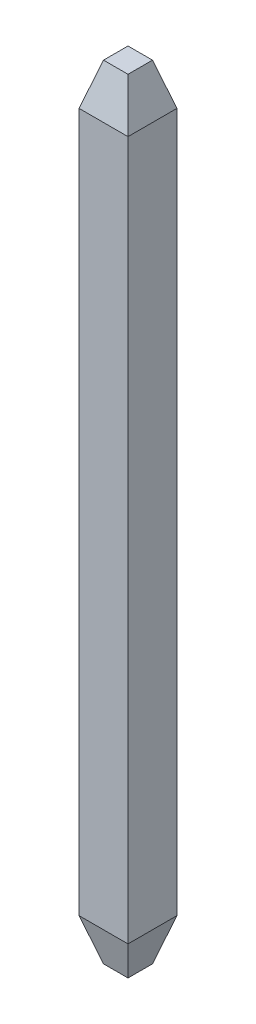
ISO-10303-21;
HEADER;
FILE_DESCRIPTION(('STEP AP214'),'2;1');
FILE_NAME('part.step','',(''),(''),'','','');
FILE_SCHEMA(('AUTOMOTIVE_DESIGN { 1 0 10303 214 1 1 1 1 }'));
ENDSEC;
DATA;
#1=APPLICATION_CONTEXT('core data for automotive mechanical design processes');
#2=APPLICATION_PROTOCOL_DEFINITION('international standard','automotive_design',2000,#1);
#3=PRODUCT_CONTEXT('',#1,'mechanical');
#4=PRODUCT('Part','Part','',(#3));
#5=PRODUCT_RELATED_PRODUCT_CATEGORY('part','',(#4));
#6=PRODUCT_DEFINITION_FORMATION('','',#4);
#7=PRODUCT_DEFINITION_CONTEXT('part definition',#1,'design');
#8=PRODUCT_DEFINITION('design','',#6,#7);
#9=PRODUCT_DEFINITION_SHAPE('','',#8);
#10=(LENGTH_UNIT() NAMED_UNIT(*) SI_UNIT(.MILLI.,.METRE.));
#11=(NAMED_UNIT(*) PLANE_ANGLE_UNIT() SI_UNIT($,.RADIAN.));
#12=(NAMED_UNIT(*) SI_UNIT($,.STERADIAN.) SOLID_ANGLE_UNIT());
#13=UNCERTAINTY_MEASURE_WITH_UNIT(LENGTH_MEASURE(1.E-05),#10,'distance_accuracy_value','');
#14=(GEOMETRIC_REPRESENTATION_CONTEXT(3) GLOBAL_UNCERTAINTY_ASSIGNED_CONTEXT((#13)) GLOBAL_UNIT_ASSIGNED_CONTEXT((#10,
#11,#12)) REPRESENTATION_CONTEXT('',''));
#15=CARTESIAN_POINT('',(0.,0.,0.));
#16=DIRECTION('',(0.,0.,1.));
#17=DIRECTION('',(1.,0.,0.));
#18=AXIS2_PLACEMENT_3D('',#15,#16,#17);
#19=CARTESIAN_POINT('',(-3.64999999998703,-10.1039999999832,-19.8399999999763));
#20=DIRECTION('',(0.,-0.281214622974643,-0.959644900900968));
#21=DIRECTION('',(0.,-0.959644900900968,0.281214622974643));
#22=AXIS2_PLACEMENT_3D('',#19,#20,#21);
#23=PLANE('',#22);
#24=DIRECTION('',(1.,0.,0.));
#25=VECTOR('',#24,1.);
#26=CARTESIAN_POINT('',(-3.96999999998703,-10.1039999999832,-19.8399999999763));
#27=LINE('',#26,#25);
#28=CARTESIAN_POINT('',(-3.96999999998703,-10.1039999999832,-19.8399999999763));
#29=VERTEX_POINT('',#28);
#30=CARTESIAN_POINT('',(-3.32999999998705,-10.1039999999832,-19.8399999999763));
#31=VERTEX_POINT('',#30);
#32=EDGE_CURVE('E11',#29,#31,#27,.T.);
#33=ORIENTED_EDGE('',*,*,#32,.T.);
#34=DIRECTION('',(-0.270714017147711,-0.923811583516622,0.270714017147728));
#35=VECTOR('',#34,1.);
#36=CARTESIAN_POINT('',(-3.32999999998702,-10.1039999999832,-19.8399999999763));
#37=LINE('',#36,#35);
#38=CARTESIAN_POINT('',(-3.48999999998704,-10.6499999999832,-19.6799999999763));
#39=VERTEX_POINT('',#38);
#40=EDGE_CURVE('E28',#31,#39,#37,.T.);
#41=ORIENTED_EDGE('',*,*,#40,.T.);
#42=DIRECTION('',(1.,0.,0.));
#43=VECTOR('',#42,1.);
#44=CARTESIAN_POINT('',(-3.80999999998703,-10.6499999999832,-19.6799999999763));
#45=LINE('',#44,#43);
#46=CARTESIAN_POINT('',(-3.80999999998703,-10.6499999999832,-19.6799999999763));
#47=VERTEX_POINT('',#46);
#48=EDGE_CURVE('E101',#47,#39,#45,.T.);
#49=ORIENTED_EDGE('',*,*,#48,.F.);
#50=DIRECTION('',(0.270714017147727,-0.923811583516618,0.270714017147727));
#51=VECTOR('',#50,1.);
#52=CARTESIAN_POINT('',(-3.96999999998703,-10.1039999999832,-19.8399999999763));
#53=LINE('',#52,#51);
#54=EDGE_CURVE('E104',#29,#47,#53,.T.);
#55=ORIENTED_EDGE('',*,*,#54,.F.);
#56=EDGE_LOOP('',(#33,#41,#49,#55));
#57=FACE_BOUND('',#56,.T.);
#58=ADVANCED_FACE('F17',(#57),#23,.T.);
#59=CARTESIAN_POINT('',(-3.32899999998701,-5.53443505344793,-19.8399999999763));
#60=DIRECTION('',(0.,0.,-1.));
#61=DIRECTION('',(0.,-1.,0.));
#62=AXIS2_PLACEMENT_3D('',#59,#60,#61);
#63=PLANE('',#62);
#64=DIRECTION('',(0.,1.,0.));
#65=VECTOR('',#64,1.);
#66=CARTESIAN_POINT('',(-3.32999999998702,-10.1039999999832,-19.8399999999763));
#67=LINE('',#66,#65);
#68=CARTESIAN_POINT('',(-3.32999999998705,-0.965870106912663,-19.8399999999763));
#69=VERTEX_POINT('',#68);
#70=EDGE_CURVE('E42',#31,#69,#67,.T.);
#71=ORIENTED_EDGE('',*,*,#70,.F.);
#72=ORIENTED_EDGE('',*,*,#32,.F.);
#73=DIRECTION('',(0.,1.,0.));
#74=VECTOR('',#73,1.);
#75=CARTESIAN_POINT('',(-3.96999999998703,-10.1039999999832,-19.8399999999763));
#76=LINE('',#75,#74);
#77=CARTESIAN_POINT('',(-3.96999999998703,-0.965870106912663,-19.8399999999763));
#78=VERTEX_POINT('',#77);
#79=EDGE_CURVE('E289',#29,#78,#76,.T.);
#80=ORIENTED_EDGE('',*,*,#79,.T.);
#81=DIRECTION('',(1.,0.,0.));
#82=VECTOR('',#81,1.);
#83=CARTESIAN_POINT('',(-3.96999999998703,-0.965870106912661,-19.8399999999763));
#84=LINE('',#83,#82);
#85=EDGE_CURVE('E198',#78,#69,#84,.T.);
#86=ORIENTED_EDGE('',*,*,#85,.T.);
#87=EDGE_LOOP('',(#71,#72,#80,#86));
#88=FACE_BOUND('',#87,.T.);
#89=ADVANCED_FACE('F453',(#88),#63,.T.);
#90=CARTESIAN_POINT('',(-3.32999999998702,-11.0738701069127,-19.5199999999763));
#91=DIRECTION('',(1.,0.,0.));
#92=DIRECTION('',(0.,1.,0.));
#93=AXIS2_PLACEMENT_3D('',#90,#91,#92);
#94=PLANE('',#93);
#95=DIRECTION('',(0.,1.,0.));
#96=VECTOR('',#95,1.);
#97=CARTESIAN_POINT('',(-3.32999999998702,-10.1039999999832,-19.1999999999763));
#98=LINE('',#97,#96);
#99=CARTESIAN_POINT('',(-3.32999999998705,-10.1039999999832,-19.1999999999763));
#100=VERTEX_POINT('',#99);
#101=CARTESIAN_POINT('',(-3.32999999998705,-0.965870106912663,-19.1999999999763));
#102=VERTEX_POINT('',#101);
#103=EDGE_CURVE('E136',#100,#102,#98,.T.);
#104=ORIENTED_EDGE('',*,*,#103,.F.);
#105=DIRECTION('',(0.,0.,1.));
#106=VECTOR('',#105,1.);
#107=CARTESIAN_POINT('',(-3.32999999998702,-10.1039999999832,-19.8399999999763));
#108=LINE('',#107,#106);
#109=EDGE_CURVE('E83',#31,#100,#108,.T.);
#110=ORIENTED_EDGE('',*,*,#109,.F.);
#111=ORIENTED_EDGE('',*,*,#70,.T.);
#112=DIRECTION('',(0.,0.,1.));
#113=VECTOR('',#112,1.);
#114=CARTESIAN_POINT('',(-3.32999999998702,-0.965870106912661,-19.8399999999763));
#115=LINE('',#114,#113);
#116=EDGE_CURVE('E139',#69,#102,#115,.T.);
#117=ORIENTED_EDGE('',*,*,#116,.T.);
#118=EDGE_LOOP('',(#104,#110,#111,#117));
#119=FACE_BOUND('',#118,.T.);
#120=ADVANCED_FACE('F270',(#119),#94,.T.);
#121=CARTESIAN_POINT('',(-3.97099999998701,-5.53543505344793,-19.1999999999763));
#122=DIRECTION('',(0.,0.,1.));
#123=DIRECTION('',(1.,0.,0.));
#124=AXIS2_PLACEMENT_3D('',#121,#122,#123);
#125=PLANE('',#124);
#126=DIRECTION('',(0.,1.,0.));
#127=VECTOR('',#126,1.);
#128=CARTESIAN_POINT('',(-3.96999999998703,-10.1039999999832,-19.1999999999763));
#129=LINE('',#128,#127);
#130=CARTESIAN_POINT('',(-3.96999999998703,-10.1039999999832,-19.1999999999763));
#131=VERTEX_POINT('',#130);
#132=CARTESIAN_POINT('',(-3.96999999998703,-0.965870106912663,-19.1999999999763));
#133=VERTEX_POINT('',#132);
#134=EDGE_CURVE('E131',#131,#133,#129,.T.);
#135=ORIENTED_EDGE('',*,*,#134,.F.);
#136=DIRECTION('',(-1.,0.,0.));
#137=VECTOR('',#136,1.);
#138=CARTESIAN_POINT('',(-3.32999999998702,-10.1039999999832,-19.1999999999763));
#139=LINE('',#138,#137);
#140=EDGE_CURVE('E116',#100,#131,#139,.T.);
#141=ORIENTED_EDGE('',*,*,#140,.F.);
#142=ORIENTED_EDGE('',*,*,#103,.T.);
#143=DIRECTION('',(-1.,0.,0.));
#144=VECTOR('',#143,1.);
#145=CARTESIAN_POINT('',(-3.32999999998702,-0.965870106912661,-19.1999999999763));
#146=LINE('',#145,#144);
#147=EDGE_CURVE('E140',#102,#133,#146,.T.);
#148=ORIENTED_EDGE('',*,*,#147,.T.);
#149=EDGE_LOOP('',(#135,#141,#142,#148));
#150=FACE_BOUND('',#149,.T.);
#151=ADVANCED_FACE('F268',(#150),#125,.T.);
#152=CARTESIAN_POINT('',(-3.64999999998703,-0.965870106912661,-19.1999999999763));
#153=DIRECTION('',(0.,0.281214622974643,0.959644900900968));
#154=DIRECTION('',(1.,0.,0.));
#155=AXIS2_PLACEMENT_3D('',#152,#153,#154);
#156=PLANE('',#155);
#157=DIRECTION('',(-0.270714017147711,0.923811583516622,-0.270714017147728));
#158=VECTOR('',#157,1.);
#159=CARTESIAN_POINT('',(-3.32999999998702,-0.965870106912661,-19.1999999999763));
#160=LINE('',#159,#158);
#161=CARTESIAN_POINT('',(-3.48999999998704,-0.419870106912663,-19.3599999999763));
#162=VERTEX_POINT('',#161);
#163=EDGE_CURVE('E21',#102,#162,#160,.T.);
#164=ORIENTED_EDGE('',*,*,#163,.T.);
#165=DIRECTION('',(-1.,0.,0.));
#166=VECTOR('',#165,1.);
#167=CARTESIAN_POINT('',(-3.48999999998701,-0.419870106912661,-19.3599999999763));
#168=LINE('',#167,#166);
#169=CARTESIAN_POINT('',(-3.80999999998703,-0.419870106912663,-19.3599999999763));
#170=VERTEX_POINT('',#169);
#171=EDGE_CURVE('E169',#162,#170,#168,.T.);
#172=ORIENTED_EDGE('',*,*,#171,.T.);
#173=DIRECTION('',(0.270714017147727,0.923811583516618,-0.270714017147727));
#174=VECTOR('',#173,1.);
#175=CARTESIAN_POINT('',(-3.96999999998703,-0.965870106912661,-19.1999999999763));
#176=LINE('',#175,#174);
#177=EDGE_CURVE('E165',#133,#170,#176,.T.);
#178=ORIENTED_EDGE('',*,*,#177,.F.);
#179=ORIENTED_EDGE('',*,*,#147,.F.);
#180=EDGE_LOOP('',(#164,#172,#178,#179));
#181=FACE_BOUND('',#180,.T.);
#182=ADVANCED_FACE('F19',(#181),#156,.T.);
#183=CARTESIAN_POINT('',(-3.96999999998703,-0.965870106912661,-19.5199999999763));
#184=DIRECTION('',(-0.959644900900968,0.281214622974643,0.));
#185=DIRECTION('',(0.,0.,1.));
#186=AXIS2_PLACEMENT_3D('',#183,#184,#185);
#187=PLANE('',#186);
#188=ORIENTED_EDGE('',*,*,#177,.T.);
#189=DIRECTION('',(0.,0.,-1.));
#190=VECTOR('',#189,1.);
#191=CARTESIAN_POINT('',(-3.80999999998703,-0.419870106912661,-19.3599999999763));
#192=LINE('',#191,#190);
#193=CARTESIAN_POINT('',(-3.80999999998703,-0.419870106912663,-19.6799999999763));
#194=VERTEX_POINT('',#193);
#195=EDGE_CURVE('E119',#170,#194,#192,.T.);
#196=ORIENTED_EDGE('',*,*,#195,.T.);
#197=DIRECTION('',(0.270714017147727,0.923811583516618,0.270714017147727));
#198=VECTOR('',#197,1.);
#199=CARTESIAN_POINT('',(-3.96999999998703,-0.965870106912661,-19.8399999999763));
#200=LINE('',#199,#198);
#201=EDGE_CURVE('E151',#78,#194,#200,.T.);
#202=ORIENTED_EDGE('',*,*,#201,.F.);
#203=DIRECTION('',(0.,0.,-1.));
#204=VECTOR('',#203,1.);
#205=CARTESIAN_POINT('',(-3.96999999998703,-0.965870106912661,-19.1999999999763));
#206=LINE('',#205,#204);
#207=EDGE_CURVE('E123',#133,#78,#206,.T.);
#208=ORIENTED_EDGE('',*,*,#207,.F.);
#209=EDGE_LOOP('',(#188,#196,#202,#208));
#210=FACE_BOUND('',#209,.T.);
#211=ADVANCED_FACE('F183',(#210),#187,.T.);
#212=CARTESIAN_POINT('',(-3.64999999998703,-0.419870106912661,-19.6809999999763));
#213=DIRECTION('',(0.,1.,0.));
#214=DIRECTION('',(1.,0.,0.));
#215=AXIS2_PLACEMENT_3D('',#212,#213,#214);
#216=PLANE('',#215);
#217=DIRECTION('',(1.,0.,0.));
#218=VECTOR('',#217,1.);
#219=CARTESIAN_POINT('',(-3.80999999998703,-0.419870106912661,-19.6799999999763));
#220=LINE('',#219,#218);
#221=CARTESIAN_POINT('',(-3.48999999998704,-0.419870106912663,-19.6799999999763));
#222=VERTEX_POINT('',#221);
#223=EDGE_CURVE('E143',#194,#222,#220,.T.);
#224=ORIENTED_EDGE('',*,*,#223,.F.);
#225=ORIENTED_EDGE('',*,*,#195,.F.);
#226=ORIENTED_EDGE('',*,*,#171,.F.);
#227=DIRECTION('',(0.,0.,1.));
#228=VECTOR('',#227,1.);
#229=CARTESIAN_POINT('',(-3.48999999998701,-0.419870106912661,-19.6799999999763));
#230=LINE('',#229,#228);
#231=EDGE_CURVE('E115',#222,#162,#230,.T.);
#232=ORIENTED_EDGE('',*,*,#231,.F.);
#233=EDGE_LOOP('',(#224,#225,#226,#232));
#234=FACE_BOUND('',#233,.T.);
#235=ADVANCED_FACE('F188',(#234),#216,.T.);
#236=CARTESIAN_POINT('',(-3.64999999998703,-10.1039999999832,-19.1999999999763));
#237=DIRECTION('',(0.,-0.281214622974643,0.959644900900968));
#238=DIRECTION('',(-1.,0.,0.));
#239=AXIS2_PLACEMENT_3D('',#236,#237,#238);
#240=PLANE('',#239);
#241=ORIENTED_EDGE('',*,*,#140,.T.);
#242=DIRECTION('',(0.270714017147727,-0.923811583516618,-0.270714017147727));
#243=VECTOR('',#242,1.);
#244=CARTESIAN_POINT('',(-3.96999999998703,-10.1039999999832,-19.1999999999763));
#245=LINE('',#244,#243);
#246=CARTESIAN_POINT('',(-3.80999999998703,-10.6499999999832,-19.3599999999763));
#247=VERTEX_POINT('',#246);
#248=EDGE_CURVE('E93',#131,#247,#245,.T.);
#249=ORIENTED_EDGE('',*,*,#248,.T.);
#250=DIRECTION('',(-1.,0.,0.));
#251=VECTOR('',#250,1.);
#252=CARTESIAN_POINT('',(-3.48999999998701,-10.6499999999832,-19.3599999999763));
#253=LINE('',#252,#251);
#254=CARTESIAN_POINT('',(-3.48999999998704,-10.6499999999832,-19.3599999999763));
#255=VERTEX_POINT('',#254);
#256=EDGE_CURVE('E90',#255,#247,#253,.T.);
#257=ORIENTED_EDGE('',*,*,#256,.F.);
#258=DIRECTION('',(-0.270714017147711,-0.923811583516622,-0.270714017147728));
#259=VECTOR('',#258,1.);
#260=CARTESIAN_POINT('',(-3.32999999998702,-10.1039999999832,-19.1999999999763));
#261=LINE('',#260,#259);
#262=EDGE_CURVE('E76',#100,#255,#261,.T.);
#263=ORIENTED_EDGE('',*,*,#262,.F.);
#264=EDGE_LOOP('',(#241,#249,#257,#263));
#265=FACE_BOUND('',#264,.T.);
#266=ADVANCED_FACE('F91',(#265),#240,.T.);
#267=CARTESIAN_POINT('',(-3.32999999998702,-0.965870106912661,-19.5199999999763));
#268=DIRECTION('',(0.959644900900973,0.281214622974627,0.));
#269=DIRECTION('',(0.,0.,-1.));
#270=AXIS2_PLACEMENT_3D('',#267,#268,#269);
#271=PLANE('',#270);
#272=DIRECTION('',(-0.270714017147711,0.923811583516622,0.270714017147728));
#273=VECTOR('',#272,1.);
#274=CARTESIAN_POINT('',(-3.32999999998702,-0.965870106912661,-19.8399999999763));
#275=LINE('',#274,#273);
#276=EDGE_CURVE('E124',#69,#222,#275,.T.);
#277=ORIENTED_EDGE('',*,*,#276,.T.);
#278=ORIENTED_EDGE('',*,*,#231,.T.);
#279=ORIENTED_EDGE('',*,*,#163,.F.);
#280=ORIENTED_EDGE('',*,*,#116,.F.);
#281=EDGE_LOOP('',(#277,#278,#279,#280));
#282=FACE_BOUND('',#281,.T.);
#283=ADVANCED_FACE('F195',(#282),#271,.T.);
#284=CARTESIAN_POINT('',(-3.64999999998703,-0.965870106912661,-19.8399999999763));
#285=DIRECTION('',(0.,0.281214622974643,-0.959644900900968));
#286=DIRECTION('',(-1.,0.,0.));
#287=AXIS2_PLACEMENT_3D('',#284,#285,#286);
#288=PLANE('',#287);
#289=ORIENTED_EDGE('',*,*,#201,.T.);
#290=ORIENTED_EDGE('',*,*,#223,.T.);
#291=ORIENTED_EDGE('',*,*,#276,.F.);
#292=ORIENTED_EDGE('',*,*,#85,.F.);
#293=EDGE_LOOP('',(#289,#290,#291,#292));
#294=FACE_BOUND('',#293,.T.);
#295=ADVANCED_FACE('F197',(#294),#288,.T.);
#296=CARTESIAN_POINT('',(-3.96999999998703,-5.53543505344793,-19.1989999999763));
#297=DIRECTION('',(-1.,0.,0.));
#298=DIRECTION('',(0.,0.,1.));
#299=AXIS2_PLACEMENT_3D('',#296,#297,#298);
#300=PLANE('',#299);
#301=ORIENTED_EDGE('',*,*,#79,.F.);
#302=DIRECTION('',(0.,0.,-1.));
#303=VECTOR('',#302,1.);
#304=CARTESIAN_POINT('',(-3.96999999998703,-10.1039999999832,-19.1999999999763));
#305=LINE('',#304,#303);
#306=EDGE_CURVE('E111',#131,#29,#305,.T.);
#307=ORIENTED_EDGE('',*,*,#306,.F.);
#308=ORIENTED_EDGE('',*,*,#134,.T.);
#309=ORIENTED_EDGE('',*,*,#207,.T.);
#310=EDGE_LOOP('',(#301,#307,#308,#309));
#311=FACE_BOUND('',#310,.T.);
#312=ADVANCED_FACE('F379',(#311),#300,.T.);
#313=CARTESIAN_POINT('',(-3.96999999998703,-10.1039999999832,-19.5199999999763));
#314=DIRECTION('',(-0.959644900900968,-0.281214622974643,0.));
#315=DIRECTION('',(-0.281214622974643,0.959644900900968,0.));
#316=AXIS2_PLACEMENT_3D('',#313,#314,#315);
#317=PLANE('',#316);
#318=ORIENTED_EDGE('',*,*,#306,.T.);
#319=ORIENTED_EDGE('',*,*,#54,.T.);
#320=DIRECTION('',(0.,0.,-1.));
#321=VECTOR('',#320,1.);
#322=CARTESIAN_POINT('',(-3.80999999998703,-10.6499999999832,-19.3599999999763));
#323=LINE('',#322,#321);
#324=EDGE_CURVE('E98',#247,#47,#323,.T.);
#325=ORIENTED_EDGE('',*,*,#324,.F.);
#326=ORIENTED_EDGE('',*,*,#248,.F.);
#327=EDGE_LOOP('',(#318,#319,#325,#326));
#328=FACE_BOUND('',#327,.T.);
#329=ADVANCED_FACE('F371',(#328),#317,.T.);
#330=CARTESIAN_POINT('',(-3.81099999998701,-10.6499999999832,-19.5199999999763));
#331=DIRECTION('',(0.,-1.,0.));
#332=DIRECTION('',(0.,0.,-1.));
#333=AXIS2_PLACEMENT_3D('',#330,#331,#332);
#334=PLANE('',#333);
#335=DIRECTION('',(0.,0.,1.));
#336=VECTOR('',#335,1.);
#337=CARTESIAN_POINT('',(-3.48999999998701,-10.6499999999832,-19.6799999999763));
#338=LINE('',#337,#336);
#339=EDGE_CURVE('E80',#39,#255,#338,.T.);
#340=ORIENTED_EDGE('',*,*,#339,.T.);
#341=ORIENTED_EDGE('',*,*,#256,.T.);
#342=ORIENTED_EDGE('',*,*,#324,.T.);
#343=ORIENTED_EDGE('',*,*,#48,.T.);
#344=EDGE_LOOP('',(#340,#341,#342,#343));
#345=FACE_BOUND('',#344,.T.);
#346=ADVANCED_FACE('F100',(#345),#334,.T.);
#347=CARTESIAN_POINT('',(-3.32999999998702,-10.1039999999832,-19.5199999999763));
#348=DIRECTION('',(0.959644900900973,-0.281214622974627,0.));
#349=DIRECTION('',(0.,0.,-1.));
#350=AXIS2_PLACEMENT_3D('',#347,#348,#349);
#351=PLANE('',#350);
#352=ORIENTED_EDGE('',*,*,#109,.T.);
#353=ORIENTED_EDGE('',*,*,#262,.T.);
#354=ORIENTED_EDGE('',*,*,#339,.F.);
#355=ORIENTED_EDGE('',*,*,#40,.F.);
#356=EDGE_LOOP('',(#352,#353,#354,#355));
#357=FACE_BOUND('',#356,.T.);
#358=ADVANCED_FACE('F78',(#357),#351,.T.);
#359=CLOSED_SHELL('',(#58,#89,#120,#151,#182,#211,#235,#266,#283,#295,#312,#329,#346,#358));
#360=MANIFOLD_SOLID_BREP('B1',#359);
#361=ADVANCED_BREP_SHAPE_REPRESENTATION('',(#18,#360),#14);
#362=SHAPE_DEFINITION_REPRESENTATION(#9,#361);
ENDSEC;
END-ISO-10303-21;
